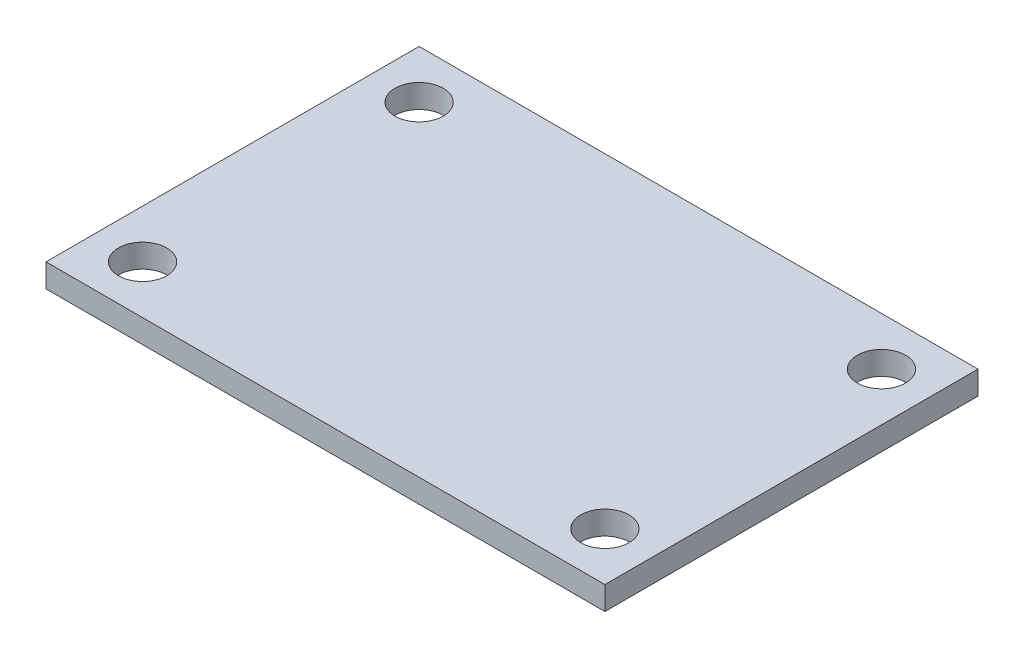
ISO-10303-21;
HEADER;
FILE_DESCRIPTION(('STEP AP214'),'2;1');
FILE_NAME('part.step','',(''),(''),'','','');
FILE_SCHEMA(('AUTOMOTIVE_DESIGN { 1 0 10303 214 1 1 1 1 }'));
ENDSEC;
DATA;
#1=APPLICATION_CONTEXT('core data for automotive mechanical design processes');
#2=APPLICATION_PROTOCOL_DEFINITION('international standard','automotive_design',2000,#1);
#3=PRODUCT_CONTEXT('',#1,'mechanical');
#4=PRODUCT('Part','Part','',(#3));
#5=PRODUCT_RELATED_PRODUCT_CATEGORY('part','',(#4));
#6=PRODUCT_DEFINITION_FORMATION('','',#4);
#7=PRODUCT_DEFINITION_CONTEXT('part definition',#1,'design');
#8=PRODUCT_DEFINITION('design','',#6,#7);
#9=PRODUCT_DEFINITION_SHAPE('','',#8);
#10=(LENGTH_UNIT() NAMED_UNIT(*) SI_UNIT(.MILLI.,.METRE.));
#11=(NAMED_UNIT(*) PLANE_ANGLE_UNIT() SI_UNIT($,.RADIAN.));
#12=(NAMED_UNIT(*) SI_UNIT($,.STERADIAN.) SOLID_ANGLE_UNIT());
#13=UNCERTAINTY_MEASURE_WITH_UNIT(LENGTH_MEASURE(1.E-05),#10,'distance_accuracy_value','');
#14=(GEOMETRIC_REPRESENTATION_CONTEXT(3) GLOBAL_UNCERTAINTY_ASSIGNED_CONTEXT((#13)) GLOBAL_UNIT_ASSIGNED_CONTEXT((#10,
#11,#12)) REPRESENTATION_CONTEXT('',''));
#15=CARTESIAN_POINT('',(0.,0.,0.));
#16=DIRECTION('',(0.,0.,1.));
#17=DIRECTION('',(1.,0.,0.));
#18=AXIS2_PLACEMENT_3D('',#15,#16,#17);
#19=CARTESIAN_POINT('',(0.,1.6,0.));
#20=DIRECTION('',(1.,0.,0.));
#21=DIRECTION('',(0.,0.,-1.));
#22=AXIS2_PLACEMENT_3D('',#19,#20,#21);
#23=PLANE('',#22);
#24=DIRECTION('',(0.,0.,1.));
#25=VECTOR('',#24,1.);
#26=CARTESIAN_POINT('',(0.,0.,0.));
#27=LINE('',#26,#25);
#28=CARTESIAN_POINT('',(0.,0.,-25.5));
#29=VERTEX_POINT('',#28);
#30=CARTESIAN_POINT('',(0.,0.,0.));
#31=VERTEX_POINT('',#30);
#32=EDGE_CURVE('E107',#29,#31,#27,.T.);
#33=ORIENTED_EDGE('',*,*,#32,.T.);
#34=DIRECTION('',(0.,-1.,0.));
#35=VECTOR('',#34,1.);
#36=CARTESIAN_POINT('',(0.,1.6,0.));
#37=LINE('',#36,#35);
#38=CARTESIAN_POINT('',(0.,1.6,0.));
#39=VERTEX_POINT('',#38);
#40=EDGE_CURVE('E11',#39,#31,#37,.T.);
#41=ORIENTED_EDGE('',*,*,#40,.F.);
#42=DIRECTION('',(0.,0.,1.));
#43=VECTOR('',#42,1.);
#44=CARTESIAN_POINT('',(0.,1.6,0.));
#45=LINE('',#44,#43);
#46=CARTESIAN_POINT('',(0.,1.6,-25.5));
#47=VERTEX_POINT('',#46);
#48=EDGE_CURVE('E91',#47,#39,#45,.T.);
#49=ORIENTED_EDGE('',*,*,#48,.F.);
#50=DIRECTION('',(0.,-1.,0.));
#51=VECTOR('',#50,1.);
#52=CARTESIAN_POINT('',(0.,1.6,-25.5));
#53=LINE('',#52,#51);
#54=EDGE_CURVE('E103',#47,#29,#53,.T.);
#55=ORIENTED_EDGE('',*,*,#54,.T.);
#56=EDGE_LOOP('',(#33,#41,#49,#55));
#57=FACE_BOUND('',#56,.T.);
#58=ADVANCED_FACE('F39',(#57),#23,.F.);
#59=CARTESIAN_POINT('',(0.,1.6,0.));
#60=DIRECTION('',(0.,0.,-1.));
#61=DIRECTION('',(-1.,0.,0.));
#62=AXIS2_PLACEMENT_3D('',#59,#60,#61);
#63=PLANE('',#62);
#64=DIRECTION('',(1.,0.,0.));
#65=VECTOR('',#64,1.);
#66=CARTESIAN_POINT('',(0.,0.,0.));
#67=LINE('',#66,#65);
#68=CARTESIAN_POINT('',(38.2,0.,0.));
#69=VERTEX_POINT('',#68);
#70=EDGE_CURVE('E96',#31,#69,#67,.T.);
#71=ORIENTED_EDGE('',*,*,#70,.T.);
#72=DIRECTION('',(0.,-1.,0.));
#73=VECTOR('',#72,1.);
#74=CARTESIAN_POINT('',(38.2,1.6,0.));
#75=LINE('',#74,#73);
#76=CARTESIAN_POINT('',(38.2,1.6,0.));
#77=VERTEX_POINT('',#76);
#78=EDGE_CURVE('E48',#77,#69,#75,.T.);
#79=ORIENTED_EDGE('',*,*,#78,.F.);
#80=DIRECTION('',(1.,0.,0.));
#81=VECTOR('',#80,1.);
#82=CARTESIAN_POINT('',(0.,1.6,0.));
#83=LINE('',#82,#81);
#84=EDGE_CURVE('E86',#39,#77,#83,.T.);
#85=ORIENTED_EDGE('',*,*,#84,.F.);
#86=ORIENTED_EDGE('',*,*,#40,.T.);
#87=EDGE_LOOP('',(#71,#79,#85,#86));
#88=FACE_BOUND('',#87,.T.);
#89=ADVANCED_FACE('F95',(#88),#63,.F.);
#90=CARTESIAN_POINT('',(38.2,1.6,0.));
#91=DIRECTION('',(-1.,0.,0.));
#92=DIRECTION('',(0.,0.,1.));
#93=AXIS2_PLACEMENT_3D('',#90,#91,#92);
#94=PLANE('',#93);
#95=DIRECTION('',(0.,0.,-1.));
#96=VECTOR('',#95,1.);
#97=CARTESIAN_POINT('',(38.2,0.,0.));
#98=LINE('',#97,#96);
#99=CARTESIAN_POINT('',(38.2,0.,-25.5));
#100=VERTEX_POINT('',#99);
#101=EDGE_CURVE('E73',#69,#100,#98,.T.);
#102=ORIENTED_EDGE('',*,*,#101,.T.);
#103=DIRECTION('',(0.,-1.,0.));
#104=VECTOR('',#103,1.);
#105=CARTESIAN_POINT('',(38.2,1.6,-25.5));
#106=LINE('',#105,#104);
#107=CARTESIAN_POINT('',(38.2,1.6,-25.5));
#108=VERTEX_POINT('',#107);
#109=EDGE_CURVE('E98',#108,#100,#106,.T.);
#110=ORIENTED_EDGE('',*,*,#109,.F.);
#111=DIRECTION('',(0.,0.,-1.));
#112=VECTOR('',#111,1.);
#113=CARTESIAN_POINT('',(38.2,1.6,0.));
#114=LINE('',#113,#112);
#115=EDGE_CURVE('E89',#77,#108,#114,.T.);
#116=ORIENTED_EDGE('',*,*,#115,.F.);
#117=ORIENTED_EDGE('',*,*,#78,.T.);
#118=EDGE_LOOP('',(#102,#110,#116,#117));
#119=FACE_BOUND('',#118,.T.);
#120=ADVANCED_FACE('F99',(#119),#94,.F.);
#121=CARTESIAN_POINT('',(0.,1.6,-25.5));
#122=DIRECTION('',(0.,0.,1.));
#123=DIRECTION('',(1.,0.,0.));
#124=AXIS2_PLACEMENT_3D('',#121,#122,#123);
#125=PLANE('',#124);
#126=DIRECTION('',(-1.,0.,0.));
#127=VECTOR('',#126,1.);
#128=CARTESIAN_POINT('',(0.,0.,-25.5));
#129=LINE('',#128,#127);
#130=EDGE_CURVE('E79',#100,#29,#129,.T.);
#131=ORIENTED_EDGE('',*,*,#130,.T.);
#132=ORIENTED_EDGE('',*,*,#54,.F.);
#133=DIRECTION('',(-1.,0.,0.));
#134=VECTOR('',#133,1.);
#135=CARTESIAN_POINT('',(0.,1.6,-25.5));
#136=LINE('',#135,#134);
#137=EDGE_CURVE('E56',#108,#47,#136,.T.);
#138=ORIENTED_EDGE('',*,*,#137,.F.);
#139=ORIENTED_EDGE('',*,*,#109,.T.);
#140=EDGE_LOOP('',(#131,#132,#138,#139));
#141=FACE_BOUND('',#140,.T.);
#142=ADVANCED_FACE('F121',(#141),#125,.F.);
#143=CARTESIAN_POINT('',(0.,1.6,0.));
#144=DIRECTION('',(0.,-1.,0.));
#145=DIRECTION('',(0.,0.,-1.));
#146=AXIS2_PLACEMENT_3D('',#143,#144,#145);
#147=PLANE('',#146);
#148=CARTESIAN_POINT('',(34.9,1.6,-3.3));
#149=DIRECTION('',(0.,1.,0.));
#150=DIRECTION('',(0.,0.,-1.));
#151=AXIS2_PLACEMENT_3D('',#148,#149,#150);
#152=CIRCLE('',#151,1.65);
#153=CARTESIAN_POINT('',(34.9,1.6,-4.95));
#154=VERTEX_POINT('',#153);
#155=EDGE_CURVE('E136',#154,#154,#152,.T.);
#156=ORIENTED_EDGE('',*,*,#155,.F.);
#157=EDGE_LOOP('',(#156));
#158=FACE_BOUND('',#157,.T.);
#159=CARTESIAN_POINT('',(3.3,1.6,-3.3));
#160=DIRECTION('',(0.,1.,0.));
#161=DIRECTION('',(0.,0.,-1.));
#162=AXIS2_PLACEMENT_3D('',#159,#160,#161);
#163=CIRCLE('',#162,1.65);
#164=CARTESIAN_POINT('',(3.3,1.6,-4.95));
#165=VERTEX_POINT('',#164);
#166=EDGE_CURVE('E144',#165,#165,#163,.T.);
#167=ORIENTED_EDGE('',*,*,#166,.F.);
#168=EDGE_LOOP('',(#167));
#169=FACE_BOUND('',#168,.T.);
#170=CARTESIAN_POINT('',(3.3,1.6,-22.2));
#171=DIRECTION('',(0.,1.,0.));
#172=DIRECTION('',(0.,0.,1.));
#173=AXIS2_PLACEMENT_3D('',#170,#171,#172);
#174=CIRCLE('',#173,1.65);
#175=CARTESIAN_POINT('',(3.3,1.6,-20.55));
#176=VERTEX_POINT('',#175);
#177=EDGE_CURVE('E152',#176,#176,#174,.T.);
#178=ORIENTED_EDGE('',*,*,#177,.F.);
#179=EDGE_LOOP('',(#178));
#180=FACE_BOUND('',#179,.T.);
#181=CARTESIAN_POINT('',(34.9,1.6,-22.2));
#182=DIRECTION('',(0.,1.,0.));
#183=DIRECTION('',(0.,0.,1.));
#184=AXIS2_PLACEMENT_3D('',#181,#182,#183);
#185=CIRCLE('',#184,1.65);
#186=CARTESIAN_POINT('',(34.9,1.6,-20.55));
#187=VERTEX_POINT('',#186);
#188=EDGE_CURVE('E128',#187,#187,#185,.T.);
#189=ORIENTED_EDGE('',*,*,#188,.F.);
#190=EDGE_LOOP('',(#189));
#191=FACE_BOUND('',#190,.T.);
#192=ORIENTED_EDGE('',*,*,#48,.T.);
#193=ORIENTED_EDGE('',*,*,#84,.T.);
#194=ORIENTED_EDGE('',*,*,#115,.T.);
#195=ORIENTED_EDGE('',*,*,#137,.T.);
#196=EDGE_LOOP('',(#192,#193,#194,#195));
#197=FACE_BOUND('',#196,.T.);
#198=ADVANCED_FACE('F87',(#158,#169,#180,#191,#197),#147,.F.);
#199=CARTESIAN_POINT('',(0.,0.,0.));
#200=DIRECTION('',(0.,-1.,0.));
#201=DIRECTION('',(0.,0.,-1.));
#202=AXIS2_PLACEMENT_3D('',#199,#200,#201);
#203=PLANE('',#202);
#204=CARTESIAN_POINT('',(34.9,0.,-3.3));
#205=DIRECTION('',(0.,1.,0.));
#206=DIRECTION('',(0.,0.,-1.));
#207=AXIS2_PLACEMENT_3D('',#204,#205,#206);
#208=CIRCLE('',#207,1.65);
#209=CARTESIAN_POINT('',(34.9,0.,-4.95));
#210=VERTEX_POINT('',#209);
#211=EDGE_CURVE('E140',#210,#210,#208,.T.);
#212=ORIENTED_EDGE('',*,*,#211,.T.);
#213=EDGE_LOOP('',(#212));
#214=FACE_BOUND('',#213,.T.);
#215=CARTESIAN_POINT('',(3.3,0.,-3.3));
#216=DIRECTION('',(0.,1.,0.));
#217=DIRECTION('',(0.,0.,-1.));
#218=AXIS2_PLACEMENT_3D('',#215,#216,#217);
#219=CIRCLE('',#218,1.65);
#220=CARTESIAN_POINT('',(3.3,0.,-4.95));
#221=VERTEX_POINT('',#220);
#222=EDGE_CURVE('E148',#221,#221,#219,.T.);
#223=ORIENTED_EDGE('',*,*,#222,.T.);
#224=EDGE_LOOP('',(#223));
#225=FACE_BOUND('',#224,.T.);
#226=CARTESIAN_POINT('',(3.3,0.,-22.2));
#227=DIRECTION('',(0.,1.,0.));
#228=DIRECTION('',(0.,0.,1.));
#229=AXIS2_PLACEMENT_3D('',#226,#227,#228);
#230=CIRCLE('',#229,1.65);
#231=CARTESIAN_POINT('',(3.3,0.,-20.55));
#232=VERTEX_POINT('',#231);
#233=EDGE_CURVE('E132',#232,#232,#230,.T.);
#234=ORIENTED_EDGE('',*,*,#233,.T.);
#235=EDGE_LOOP('',(#234));
#236=FACE_BOUND('',#235,.T.);
#237=CARTESIAN_POINT('',(34.9,0.,-22.2));
#238=DIRECTION('',(0.,1.,0.));
#239=DIRECTION('',(0.,0.,1.));
#240=AXIS2_PLACEMENT_3D('',#237,#238,#239);
#241=CIRCLE('',#240,1.65);
#242=CARTESIAN_POINT('',(34.9,0.,-20.55));
#243=VERTEX_POINT('',#242);
#244=EDGE_CURVE('E111',#243,#243,#241,.T.);
#245=ORIENTED_EDGE('',*,*,#244,.T.);
#246=EDGE_LOOP('',(#245));
#247=FACE_BOUND('',#246,.T.);
#248=ORIENTED_EDGE('',*,*,#32,.F.);
#249=ORIENTED_EDGE('',*,*,#130,.F.);
#250=ORIENTED_EDGE('',*,*,#101,.F.);
#251=ORIENTED_EDGE('',*,*,#70,.F.);
#252=EDGE_LOOP('',(#248,#249,#250,#251));
#253=FACE_BOUND('',#252,.T.);
#254=ADVANCED_FACE('F124',(#214,#225,#236,#247,#253),#203,.T.);
#255=CARTESIAN_POINT('',(34.9,0.,-22.2));
#256=DIRECTION('',(0.,1.,0.));
#257=DIRECTION('',(0.,0.,1.));
#258=AXIS2_PLACEMENT_3D('',#255,#256,#257);
#259=CYLINDRICAL_SURFACE('',#258,1.65);
#260=ORIENTED_EDGE('',*,*,#244,.F.);
#261=EDGE_LOOP('',(#260));
#262=FACE_BOUND('',#261,.T.);
#263=ORIENTED_EDGE('',*,*,#188,.T.);
#264=EDGE_LOOP('',(#263));
#265=FACE_BOUND('',#264,.T.);
#266=ADVANCED_FACE('F166',(#262,#265),#259,.F.);
#267=CARTESIAN_POINT('',(3.3,0.,-22.2));
#268=DIRECTION('',(0.,1.,0.));
#269=DIRECTION('',(0.,0.,1.));
#270=AXIS2_PLACEMENT_3D('',#267,#268,#269);
#271=CYLINDRICAL_SURFACE('',#270,1.65);
#272=ORIENTED_EDGE('',*,*,#233,.F.);
#273=EDGE_LOOP('',(#272));
#274=FACE_BOUND('',#273,.T.);
#275=ORIENTED_EDGE('',*,*,#177,.T.);
#276=EDGE_LOOP('',(#275));
#277=FACE_BOUND('',#276,.T.);
#278=ADVANCED_FACE('F162',(#274,#277),#271,.F.);
#279=CARTESIAN_POINT('',(3.3,0.,-3.3));
#280=DIRECTION('',(0.,1.,0.));
#281=DIRECTION('',(0.,0.,1.));
#282=AXIS2_PLACEMENT_3D('',#279,#280,#281);
#283=CYLINDRICAL_SURFACE('',#282,1.65);
#284=ORIENTED_EDGE('',*,*,#222,.F.);
#285=EDGE_LOOP('',(#284));
#286=FACE_BOUND('',#285,.T.);
#287=ORIENTED_EDGE('',*,*,#166,.T.);
#288=EDGE_LOOP('',(#287));
#289=FACE_BOUND('',#288,.T.);
#290=ADVANCED_FACE('F165',(#286,#289),#283,.F.);
#291=CARTESIAN_POINT('',(34.9,0.,-3.3));
#292=DIRECTION('',(0.,1.,0.));
#293=DIRECTION('',(0.,0.,1.));
#294=AXIS2_PLACEMENT_3D('',#291,#292,#293);
#295=CYLINDRICAL_SURFACE('',#294,1.65);
#296=ORIENTED_EDGE('',*,*,#211,.F.);
#297=EDGE_LOOP('',(#296));
#298=FACE_BOUND('',#297,.T.);
#299=ORIENTED_EDGE('',*,*,#155,.T.);
#300=EDGE_LOOP('',(#299));
#301=FACE_BOUND('',#300,.T.);
#302=ADVANCED_FACE('F227',(#298,#301),#295,.F.);
#303=CLOSED_SHELL('',(#58,#89,#120,#142,#198,#254,#266,#278,#290,#302));
#304=MANIFOLD_SOLID_BREP('B2',#303);
#305=ADVANCED_BREP_SHAPE_REPRESENTATION('',(#18,#304),#14);
#306=SHAPE_DEFINITION_REPRESENTATION(#9,#305);
ENDSEC;
END-ISO-10303-21;
